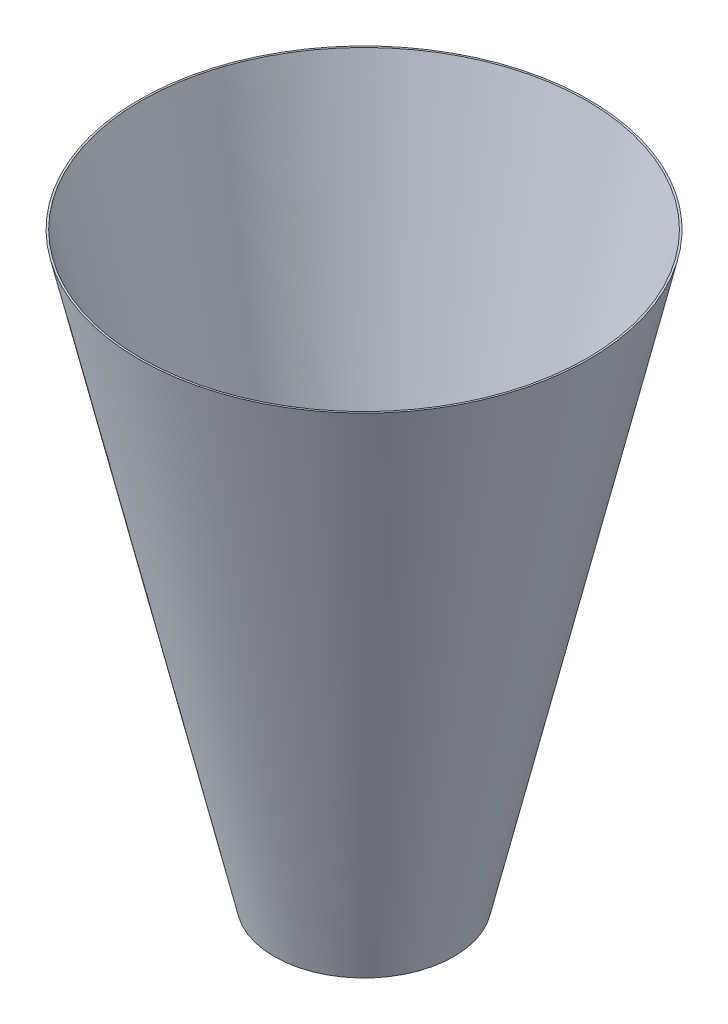
ISO-10303-21;
HEADER;
FILE_DESCRIPTION(('STEP AP214'),'2;1');
FILE_NAME('part.step','',(''),(''),'','','');
FILE_SCHEMA(('AUTOMOTIVE_DESIGN { 1 0 10303 214 1 1 1 1 }'));
ENDSEC;
DATA;
#1=APPLICATION_CONTEXT('core data for automotive mechanical design processes');
#2=APPLICATION_PROTOCOL_DEFINITION('international standard','automotive_design',2000,#1);
#3=PRODUCT_CONTEXT('',#1,'mechanical');
#4=PRODUCT('Part','Part','',(#3));
#5=PRODUCT_RELATED_PRODUCT_CATEGORY('part','',(#4));
#6=PRODUCT_DEFINITION_FORMATION('','',#4);
#7=PRODUCT_DEFINITION_CONTEXT('part definition',#1,'design');
#8=PRODUCT_DEFINITION('design','',#6,#7);
#9=PRODUCT_DEFINITION_SHAPE('','',#8);
#10=(LENGTH_UNIT() NAMED_UNIT(*) SI_UNIT(.MILLI.,.METRE.));
#11=(NAMED_UNIT(*) PLANE_ANGLE_UNIT() SI_UNIT($,.RADIAN.));
#12=(NAMED_UNIT(*) SI_UNIT($,.STERADIAN.) SOLID_ANGLE_UNIT());
#13=UNCERTAINTY_MEASURE_WITH_UNIT(LENGTH_MEASURE(1.E-05),#10,'distance_accuracy_value','');
#14=(GEOMETRIC_REPRESENTATION_CONTEXT(3) GLOBAL_UNCERTAINTY_ASSIGNED_CONTEXT((#13)) GLOBAL_UNIT_ASSIGNED_CONTEXT((#10,
#11,#12)) REPRESENTATION_CONTEXT('',''));
#15=CARTESIAN_POINT('',(0.,0.,0.));
#16=DIRECTION('',(0.,0.,1.));
#17=DIRECTION('',(1.,0.,0.));
#18=AXIS2_PLACEMENT_3D('',#15,#16,#17);
#19=CARTESIAN_POINT('',(0.,-650.,0.));
#20=DIRECTION('',(0.,1.,0.));
#21=DIRECTION('',(0.,0.,1.));
#22=AXIS2_PLACEMENT_3D('',#19,#20,#21);
#23=CONICAL_SURFACE('',#22,97.9474362978265,0.226798848053886);
#24=CARTESIAN_POINT('',(0.,0.,0.));
#25=DIRECTION('',(0.,1.,0.));
#26=DIRECTION('',(0.,0.,1.));
#27=AXIS2_PLACEMENT_3D('',#24,#25,#26);
#28=CIRCLE('',#27,247.947436297827);
#29=CARTESIAN_POINT('',(0.,0.,247.947436297827));
#30=VERTEX_POINT('',#29);
#31=EDGE_CURVE('E10',#30,#30,#28,.T.);
#32=ORIENTED_EDGE('',*,*,#31,.T.);
#33=EDGE_LOOP('',(#32));
#34=FACE_BOUND('',#33,.T.);
#35=CARTESIAN_POINT('',(0.,-650.,0.));
#36=DIRECTION('',(0.,1.,0.));
#37=DIRECTION('',(0.,0.,1.));
#38=AXIS2_PLACEMENT_3D('',#35,#36,#37);
#39=CIRCLE('',#38,97.9474362978265);
#40=CARTESIAN_POINT('',(0.,-650.,97.9474362978265));
#41=VERTEX_POINT('',#40);
#42=EDGE_CURVE('E52',#41,#41,#39,.T.);
#43=ORIENTED_EDGE('',*,*,#42,.F.);
#44=EDGE_LOOP('',(#43));
#45=FACE_BOUND('',#44,.T.);
#46=ADVANCED_FACE('F38',(#34,#45),#23,.F.);
#47=CARTESIAN_POINT('',(-250.,0.,0.));
#48=DIRECTION('',(0.,1.,0.));
#49=DIRECTION('',(0.,0.,1.));
#50=AXIS2_PLACEMENT_3D('',#47,#48,#49);
#51=PLANE('',#50);
#52=CARTESIAN_POINT('',(0.,0.,0.));
#53=DIRECTION('',(0.,1.,0.));
#54=DIRECTION('',(0.,0.,1.));
#55=AXIS2_PLACEMENT_3D('',#52,#53,#54);
#56=CIRCLE('',#55,250.);
#57=CARTESIAN_POINT('',(0.,0.,250.));
#58=VERTEX_POINT('',#57);
#59=EDGE_CURVE('E44',#58,#58,#56,.T.);
#60=ORIENTED_EDGE('',*,*,#59,.T.);
#61=EDGE_LOOP('',(#60));
#62=FACE_BOUND('',#61,.T.);
#63=ORIENTED_EDGE('',*,*,#31,.F.);
#64=EDGE_LOOP('',(#63));
#65=FACE_BOUND('',#64,.T.);
#66=ADVANCED_FACE('F62',(#62,#65),#51,.T.);
#67=CARTESIAN_POINT('',(0.,0.,0.));
#68=DIRECTION('',(0.,1.,0.));
#69=DIRECTION('',(0.,0.,1.));
#70=AXIS2_PLACEMENT_3D('',#67,#68,#69);
#71=CONICAL_SURFACE('',#70,250.,0.226798848053886);
#72=CARTESIAN_POINT('',(0.,-650.,0.));
#73=DIRECTION('',(0.,1.,0.));
#74=DIRECTION('',(0.,0.,1.));
#75=AXIS2_PLACEMENT_3D('',#72,#73,#74);
#76=CIRCLE('',#75,99.9999999999999);
#77=CARTESIAN_POINT('',(0.,-650.,99.9999999999999));
#78=VERTEX_POINT('',#77);
#79=EDGE_CURVE('E48',#78,#78,#76,.T.);
#80=ORIENTED_EDGE('',*,*,#79,.T.);
#81=EDGE_LOOP('',(#80));
#82=FACE_BOUND('',#81,.T.);
#83=ORIENTED_EDGE('',*,*,#59,.F.);
#84=EDGE_LOOP('',(#83));
#85=FACE_BOUND('',#84,.T.);
#86=ADVANCED_FACE('F66',(#82,#85),#71,.T.);
#87=CARTESIAN_POINT('',(-99.9999999999999,-650.,0.));
#88=DIRECTION('',(0.,-1.,0.));
#89=DIRECTION('',(0.,0.,-1.));
#90=AXIS2_PLACEMENT_3D('',#87,#88,#89);
#91=PLANE('',#90);
#92=ORIENTED_EDGE('',*,*,#42,.T.);
#93=EDGE_LOOP('',(#92));
#94=FACE_BOUND('',#93,.T.);
#95=ORIENTED_EDGE('',*,*,#79,.F.);
#96=EDGE_LOOP('',(#95));
#97=FACE_BOUND('',#96,.T.);
#98=ADVANCED_FACE('F58',(#94,#97),#91,.T.);
#99=CLOSED_SHELL('',(#46,#66,#86,#98));
#100=MANIFOLD_SOLID_BREP('B2',#99);
#101=ADVANCED_BREP_SHAPE_REPRESENTATION('',(#18,#100),#14);
#102=SHAPE_DEFINITION_REPRESENTATION(#9,#101);
ENDSEC;
END-ISO-10303-21;
